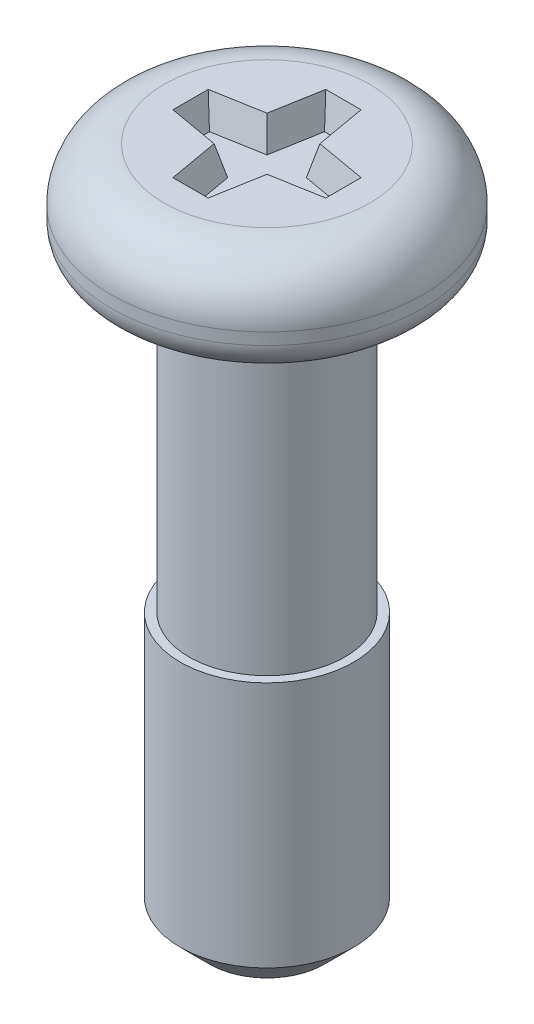
ISO-10303-21;
HEADER;
FILE_DESCRIPTION(('STEP AP214'),'2;1');
FILE_NAME('part.step','',(''),(''),'','','');
FILE_SCHEMA(('AUTOMOTIVE_DESIGN { 1 0 10303 214 1 1 1 1 }'));
ENDSEC;
DATA;
#1=APPLICATION_CONTEXT('core data for automotive mechanical design processes');
#2=APPLICATION_PROTOCOL_DEFINITION('international standard','automotive_design',2000,#1);
#3=PRODUCT_CONTEXT('',#1,'mechanical');
#4=PRODUCT('Part','Part','',(#3));
#5=PRODUCT_RELATED_PRODUCT_CATEGORY('part','',(#4));
#6=PRODUCT_DEFINITION_FORMATION('','',#4);
#7=PRODUCT_DEFINITION_CONTEXT('part definition',#1,'design');
#8=PRODUCT_DEFINITION('design','',#6,#7);
#9=PRODUCT_DEFINITION_SHAPE('','',#8);
#10=(LENGTH_UNIT() NAMED_UNIT(*) SI_UNIT(.MILLI.,.METRE.));
#11=(NAMED_UNIT(*) PLANE_ANGLE_UNIT() SI_UNIT($,.RADIAN.));
#12=(NAMED_UNIT(*) SI_UNIT($,.STERADIAN.) SOLID_ANGLE_UNIT());
#13=UNCERTAINTY_MEASURE_WITH_UNIT(LENGTH_MEASURE(1.E-05),#10,'distance_accuracy_value','');
#14=(GEOMETRIC_REPRESENTATION_CONTEXT(3) GLOBAL_UNCERTAINTY_ASSIGNED_CONTEXT((#13)) GLOBAL_UNIT_ASSIGNED_CONTEXT((#10,
#11,#12)) REPRESENTATION_CONTEXT('',''));
#15=CARTESIAN_POINT('',(0.,0.,0.));
#16=DIRECTION('',(0.,0.,1.));
#17=DIRECTION('',(1.,0.,0.));
#18=AXIS2_PLACEMENT_3D('',#15,#16,#17);
#19=CARTESIAN_POINT('',(1.75,0.,0.));
#20=DIRECTION('',(0.,-1.,0.));
#21=DIRECTION('',(1.,0.,0.));
#22=AXIS2_PLACEMENT_3D('',#19,#20,#21);
#23=PLANE('',#22);
#24=DIRECTION('',(-1.,0.,0.));
#25=VECTOR('',#24,1.);
#26=CARTESIAN_POINT('',(-0.300122066397808,0.,-1.3));
#27=LINE('',#26,#25);
#28=CARTESIAN_POINT('',(0.300122066397808,0.,-1.3));
#29=VERTEX_POINT('',#28);
#30=CARTESIAN_POINT('',(-0.300122066397808,0.,-1.3));
#31=VERTEX_POINT('',#30);
#32=EDGE_CURVE('E141',#29,#31,#27,.T.);
#33=ORIENTED_EDGE('',*,*,#32,.F.);
#34=DIRECTION('',(-0.173648177666927,0.,-0.984807753012208));
#35=VECTOR('',#34,1.);
#36=CARTESIAN_POINT('',(0.300122066397808,0.,-1.3));
#37=LINE('',#36,#35);
#38=CARTESIAN_POINT('',(0.45,0.,-0.45));
#39=VERTEX_POINT('',#38);
#40=EDGE_CURVE('E49',#39,#29,#37,.T.);
#41=ORIENTED_EDGE('',*,*,#40,.F.);
#42=DIRECTION('',(-0.984807753012208,0.,-0.173648177666927));
#43=VECTOR('',#42,1.);
#44=CARTESIAN_POINT('',(0.45,0.,-0.45));
#45=LINE('',#44,#43);
#46=CARTESIAN_POINT('',(1.3,0.,-0.300122066397808));
#47=VERTEX_POINT('',#46);
#48=EDGE_CURVE('E173',#47,#39,#45,.T.);
#49=ORIENTED_EDGE('',*,*,#48,.F.);
#50=DIRECTION('',(0.,0.,-1.));
#51=VECTOR('',#50,1.);
#52=CARTESIAN_POINT('',(1.3,0.,-0.300122066397808));
#53=LINE('',#52,#51);
#54=CARTESIAN_POINT('',(1.3,0.,0.300122066397808));
#55=VERTEX_POINT('',#54);
#56=EDGE_CURVE('E171',#55,#47,#53,.T.);
#57=ORIENTED_EDGE('',*,*,#56,.F.);
#58=DIRECTION('',(0.984807753012208,0.,-0.173648177666927));
#59=VECTOR('',#58,1.);
#60=CARTESIAN_POINT('',(0.45,0.,0.45));
#61=LINE('',#60,#59);
#62=CARTESIAN_POINT('',(0.45,0.,0.45));
#63=VERTEX_POINT('',#62);
#64=EDGE_CURVE('E168',#63,#55,#61,.T.);
#65=ORIENTED_EDGE('',*,*,#64,.F.);
#66=DIRECTION('',(0.173648177666927,0.,-0.984807753012208));
#67=VECTOR('',#66,1.);
#68=CARTESIAN_POINT('',(0.300122066397808,0.,1.3));
#69=LINE('',#68,#67);
#70=CARTESIAN_POINT('',(0.300122066397808,0.,1.3));
#71=VERTEX_POINT('',#70);
#72=EDGE_CURVE('E165',#71,#63,#69,.T.);
#73=ORIENTED_EDGE('',*,*,#72,.F.);
#74=DIRECTION('',(1.,0.,0.));
#75=VECTOR('',#74,1.);
#76=CARTESIAN_POINT('',(-0.300122066397808,0.,1.3));
#77=LINE('',#76,#75);
#78=CARTESIAN_POINT('',(-0.300122066397808,0.,1.3));
#79=VERTEX_POINT('',#78);
#80=EDGE_CURVE('E162',#79,#71,#77,.T.);
#81=ORIENTED_EDGE('',*,*,#80,.F.);
#82=DIRECTION('',(0.173648177666927,0.,0.984807753012208));
#83=VECTOR('',#82,1.);
#84=CARTESIAN_POINT('',(-0.300122066397808,0.,1.3));
#85=LINE('',#84,#83);
#86=CARTESIAN_POINT('',(-0.45,0.,0.45));
#87=VERTEX_POINT('',#86);
#88=EDGE_CURVE('E159',#87,#79,#85,.T.);
#89=ORIENTED_EDGE('',*,*,#88,.F.);
#90=DIRECTION('',(0.984807753012208,0.,0.173648177666927));
#91=VECTOR('',#90,1.);
#92=CARTESIAN_POINT('',(-0.45,0.,0.45));
#93=LINE('',#92,#91);
#94=CARTESIAN_POINT('',(-1.3,0.,0.300122066397808));
#95=VERTEX_POINT('',#94);
#96=EDGE_CURVE('E156',#95,#87,#93,.T.);
#97=ORIENTED_EDGE('',*,*,#96,.F.);
#98=DIRECTION('',(0.,0.,1.));
#99=VECTOR('',#98,1.);
#100=CARTESIAN_POINT('',(-1.3,0.,-0.300122066397808));
#101=LINE('',#100,#99);
#102=CARTESIAN_POINT('',(-1.3,0.,-0.300122066397808));
#103=VERTEX_POINT('',#102);
#104=EDGE_CURVE('E150',#103,#95,#101,.T.);
#105=ORIENTED_EDGE('',*,*,#104,.F.);
#106=DIRECTION('',(-0.984807753012208,0.,0.173648177666927));
#107=VECTOR('',#106,1.);
#108=CARTESIAN_POINT('',(-0.45,0.,-0.45));
#109=LINE('',#108,#107);
#110=CARTESIAN_POINT('',(-0.45,0.,-0.45));
#111=VERTEX_POINT('',#110);
#112=EDGE_CURVE('E148',#111,#103,#109,.T.);
#113=ORIENTED_EDGE('',*,*,#112,.F.);
#114=DIRECTION('',(-0.173648177666927,0.,0.984807753012208));
#115=VECTOR('',#114,1.);
#116=CARTESIAN_POINT('',(-0.300122066397808,0.,-1.3));
#117=LINE('',#116,#115);
#118=EDGE_CURVE('E132',#31,#111,#117,.T.);
#119=ORIENTED_EDGE('',*,*,#118,.F.);
#120=EDGE_LOOP('',(#33,#41,#49,#57,#65,#73,#81,#89,#97,#105,#113,#119));
#121=FACE_BOUND('',#120,.T.);
#122=CARTESIAN_POINT('',(0.,0.,0.));
#123=DIRECTION('',(0.,1.,0.));
#124=DIRECTION('',(-1.,0.,0.));
#125=AXIS2_PLACEMENT_3D('',#122,#123,#124);
#126=CIRCLE('',#125,1.75);
#127=CARTESIAN_POINT('',(-1.75,0.,0.));
#128=VERTEX_POINT('',#127);
#129=EDGE_CURVE('E11',#128,#128,#126,.T.);
#130=ORIENTED_EDGE('',*,*,#129,.T.);
#131=EDGE_LOOP('',(#130));
#132=FACE_BOUND('',#131,.T.);
#133=ADVANCED_FACE('F35',(#121,#132),#23,.F.);
#134=CARTESIAN_POINT('',(0.,-0.9,0.));
#135=DIRECTION('',(0.,1.,0.));
#136=DIRECTION('',(-1.,0.,0.));
#137=AXIS2_PLACEMENT_3D('',#134,#135,#136);
#138=TOROIDAL_SURFACE('',#137,1.75,0.9);
#139=ORIENTED_EDGE('',*,*,#129,.F.);
#140=EDGE_LOOP('',(#139));
#141=FACE_BOUND('',#140,.T.);
#142=CARTESIAN_POINT('',(0.,-0.9,0.));
#143=DIRECTION('',(0.,1.,0.));
#144=DIRECTION('',(-1.,0.,0.));
#145=AXIS2_PLACEMENT_3D('',#142,#143,#144);
#146=CIRCLE('',#145,2.65);
#147=CARTESIAN_POINT('',(-2.65,-0.900000000000001,0.));
#148=VERTEX_POINT('',#147);
#149=EDGE_CURVE('E42',#148,#148,#146,.T.);
#150=ORIENTED_EDGE('',*,*,#149,.T.);
#151=EDGE_LOOP('',(#150));
#152=FACE_BOUND('',#151,.T.);
#153=ADVANCED_FACE('F252',(#141,#152),#138,.T.);
#154=CARTESIAN_POINT('',(0.,0.,0.));
#155=DIRECTION('',(0.,1.,0.));
#156=DIRECTION('',(-1.,0.,0.));
#157=AXIS2_PLACEMENT_3D('',#154,#155,#156);
#158=CYLINDRICAL_SURFACE('',#157,2.65);
#159=ORIENTED_EDGE('',*,*,#149,.F.);
#160=EDGE_LOOP('',(#159));
#161=FACE_BOUND('',#160,.T.);
#162=CARTESIAN_POINT('',(0.,-1.1,0.));
#163=DIRECTION('',(0.,1.,0.));
#164=DIRECTION('',(-1.,0.,0.));
#165=AXIS2_PLACEMENT_3D('',#162,#163,#164);
#166=CIRCLE('',#165,2.65);
#167=CARTESIAN_POINT('',(-2.65,-1.1,0.));
#168=VERTEX_POINT('',#167);
#169=EDGE_CURVE('E247',#168,#168,#166,.T.);
#170=ORIENTED_EDGE('',*,*,#169,.T.);
#171=EDGE_LOOP('',(#170));
#172=FACE_BOUND('',#171,.T.);
#173=ADVANCED_FACE('F254',(#161,#172),#158,.T.);
#174=CARTESIAN_POINT('',(0.,-1.1,0.));
#175=DIRECTION('',(0.,1.,0.));
#176=DIRECTION('',(-1.,0.,0.));
#177=AXIS2_PLACEMENT_3D('',#174,#175,#176);
#178=TOROIDAL_SURFACE('',#177,2.15,0.5);
#179=ORIENTED_EDGE('',*,*,#169,.F.);
#180=EDGE_LOOP('',(#179));
#181=FACE_BOUND('',#180,.T.);
#182=CARTESIAN_POINT('',(0.,-1.6,0.));
#183=DIRECTION('',(0.,1.,0.));
#184=DIRECTION('',(-1.,0.,0.));
#185=AXIS2_PLACEMENT_3D('',#182,#183,#184);
#186=CIRCLE('',#185,2.15);
#187=CARTESIAN_POINT('',(-2.15,-1.6,0.));
#188=VERTEX_POINT('',#187);
#189=EDGE_CURVE('E244',#188,#188,#186,.T.);
#190=ORIENTED_EDGE('',*,*,#189,.T.);
#191=EDGE_LOOP('',(#190));
#192=FACE_BOUND('',#191,.T.);
#193=ADVANCED_FACE('F257',(#181,#192),#178,.T.);
#194=CARTESIAN_POINT('',(1.475,-1.6,0.));
#195=DIRECTION('',(0.,1.,0.));
#196=DIRECTION('',(-1.,0.,0.));
#197=AXIS2_PLACEMENT_3D('',#194,#195,#196);
#198=PLANE('',#197);
#199=ORIENTED_EDGE('',*,*,#189,.F.);
#200=EDGE_LOOP('',(#199));
#201=FACE_BOUND('',#200,.T.);
#202=CARTESIAN_POINT('',(0.,-1.6,0.));
#203=DIRECTION('',(0.,1.,0.));
#204=DIRECTION('',(-1.,0.,0.));
#205=AXIS2_PLACEMENT_3D('',#202,#203,#204);
#206=CIRCLE('',#205,1.475);
#207=CARTESIAN_POINT('',(-1.475,-1.6,0.));
#208=VERTEX_POINT('',#207);
#209=EDGE_CURVE('E241',#208,#208,#206,.T.);
#210=ORIENTED_EDGE('',*,*,#209,.T.);
#211=EDGE_LOOP('',(#210));
#212=FACE_BOUND('',#211,.T.);
#213=ADVANCED_FACE('F263',(#201,#212),#198,.F.);
#214=CARTESIAN_POINT('',(0.,-1.75,0.));
#215=DIRECTION('',(0.,1.,0.));
#216=DIRECTION('',(-1.,0.,0.));
#217=AXIS2_PLACEMENT_3D('',#214,#215,#216);
#218=TOROIDAL_SURFACE('',#217,1.475,0.15);
#219=ORIENTED_EDGE('',*,*,#209,.F.);
#220=EDGE_LOOP('',(#219));
#221=FACE_BOUND('',#220,.T.);
#222=CARTESIAN_POINT('',(0.,-1.75,0.));
#223=DIRECTION('',(0.,1.,0.));
#224=DIRECTION('',(-1.,0.,0.));
#225=AXIS2_PLACEMENT_3D('',#222,#223,#224);
#226=CIRCLE('',#225,1.325);
#227=CARTESIAN_POINT('',(-1.325,-1.75,0.));
#228=VERTEX_POINT('',#227);
#229=EDGE_CURVE('E238',#228,#228,#226,.T.);
#230=ORIENTED_EDGE('',*,*,#229,.T.);
#231=EDGE_LOOP('',(#230));
#232=FACE_BOUND('',#231,.T.);
#233=ADVANCED_FACE('F269',(#221,#232),#218,.F.);
#234=CARTESIAN_POINT('',(0.,0.,0.));
#235=DIRECTION('',(0.,1.,0.));
#236=DIRECTION('',(-1.,0.,0.));
#237=AXIS2_PLACEMENT_3D('',#234,#235,#236);
#238=CYLINDRICAL_SURFACE('',#237,1.325);
#239=ORIENTED_EDGE('',*,*,#229,.F.);
#240=EDGE_LOOP('',(#239));
#241=FACE_BOUND('',#240,.T.);
#242=CARTESIAN_POINT('',(0.,-6.9,0.));
#243=DIRECTION('',(0.,1.,0.));
#244=DIRECTION('',(-1.,0.,0.));
#245=AXIS2_PLACEMENT_3D('',#242,#243,#244);
#246=CIRCLE('',#245,1.325);
#247=CARTESIAN_POINT('',(-1.325,-6.9,0.));
#248=VERTEX_POINT('',#247);
#249=EDGE_CURVE('E235',#248,#248,#246,.T.);
#250=ORIENTED_EDGE('',*,*,#249,.T.);
#251=EDGE_LOOP('',(#250));
#252=FACE_BOUND('',#251,.T.);
#253=ADVANCED_FACE('F275',(#241,#252),#238,.T.);
#254=CARTESIAN_POINT('',(1.325,-6.9,0.));
#255=DIRECTION('',(0.,-1.,0.));
#256=DIRECTION('',(1.,0.,0.));
#257=AXIS2_PLACEMENT_3D('',#254,#255,#256);
#258=PLANE('',#257);
#259=ORIENTED_EDGE('',*,*,#249,.F.);
#260=EDGE_LOOP('',(#259));
#261=FACE_BOUND('',#260,.T.);
#262=CARTESIAN_POINT('',(0.,-6.9,0.));
#263=DIRECTION('',(0.,1.,0.));
#264=DIRECTION('',(-1.,0.,0.));
#265=AXIS2_PLACEMENT_3D('',#262,#263,#264);
#266=CIRCLE('',#265,1.475);
#267=CARTESIAN_POINT('',(-1.475,-6.9,0.));
#268=VERTEX_POINT('',#267);
#269=EDGE_CURVE('E232',#268,#268,#266,.T.);
#270=ORIENTED_EDGE('',*,*,#269,.T.);
#271=EDGE_LOOP('',(#270));
#272=FACE_BOUND('',#271,.T.);
#273=ADVANCED_FACE('F281',(#261,#272),#258,.F.);
#274=CARTESIAN_POINT('',(0.,0.,0.));
#275=DIRECTION('',(0.,1.,0.));
#276=DIRECTION('',(-1.,0.,0.));
#277=AXIS2_PLACEMENT_3D('',#274,#275,#276);
#278=CYLINDRICAL_SURFACE('',#277,1.475);
#279=ORIENTED_EDGE('',*,*,#269,.F.);
#280=EDGE_LOOP('',(#279));
#281=FACE_BOUND('',#280,.T.);
#282=CARTESIAN_POINT('',(0.,-11.1,0.));
#283=DIRECTION('',(0.,1.,0.));
#284=DIRECTION('',(-1.,0.,0.));
#285=AXIS2_PLACEMENT_3D('',#282,#283,#284);
#286=CIRCLE('',#285,1.475);
#287=CARTESIAN_POINT('',(-1.475,-11.1,0.));
#288=VERTEX_POINT('',#287);
#289=EDGE_CURVE('E229',#288,#288,#286,.T.);
#290=ORIENTED_EDGE('',*,*,#289,.T.);
#291=EDGE_LOOP('',(#290));
#292=FACE_BOUND('',#291,.T.);
#293=ADVANCED_FACE('F287',(#281,#292),#278,.T.);
#294=CARTESIAN_POINT('',(0.,-11.6,0.));
#295=DIRECTION('',(0.,1.,0.));
#296=DIRECTION('',(-1.,0.,0.));
#297=AXIS2_PLACEMENT_3D('',#294,#295,#296);
#298=CONICAL_SURFACE('',#297,0.975000000000005,0.785398163397443);
#299=ORIENTED_EDGE('',*,*,#289,.F.);
#300=EDGE_LOOP('',(#299));
#301=FACE_BOUND('',#300,.T.);
#302=CARTESIAN_POINT('',(0.,-11.6,0.));
#303=DIRECTION('',(0.,1.,0.));
#304=DIRECTION('',(-1.,0.,0.));
#305=AXIS2_PLACEMENT_3D('',#302,#303,#304);
#306=CIRCLE('',#305,0.975000000000005);
#307=CARTESIAN_POINT('',(-0.975000000000003,-11.6,0.));
#308=VERTEX_POINT('',#307);
#309=EDGE_CURVE('E177',#308,#308,#306,.T.);
#310=ORIENTED_EDGE('',*,*,#309,.T.);
#311=EDGE_LOOP('',(#310));
#312=FACE_BOUND('',#311,.T.);
#313=ADVANCED_FACE('F293',(#301,#312),#298,.T.);
#314=CARTESIAN_POINT('',(0.,-11.6,0.));
#315=DIRECTION('',(0.,1.,0.));
#316=DIRECTION('',(-1.,0.,0.));
#317=AXIS2_PLACEMENT_3D('',#314,#315,#316);
#318=PLANE('',#317);
#319=ORIENTED_EDGE('',*,*,#309,.F.);
#320=EDGE_LOOP('',(#319));
#321=FACE_BOUND('',#320,.T.);
#322=ADVANCED_FACE('F299',(#321),#318,.F.);
#323=CARTESIAN_POINT('',(0.300122066397808,0.,-1.3));
#324=DIRECTION('',(0.951251242564198,-0.258819045102521,-0.167731259496517));
#325=DIRECTION('',(0.262538491736643,0.964921520309631,0.));
#326=AXIS2_PLACEMENT_3D('',#323,#324,#325);
#327=PLANE('',#326);
#328=ORIENTED_EDGE('',*,*,#40,.T.);
#329=DIRECTION('',(0.212227769095221,0.943922256203466,-0.252923206267483));
#330=VECTOR('',#329,1.);
#331=CARTESIAN_POINT('',(0.300122066397808,0.,-1.3));
#332=LINE('',#331,#330);
#333=CARTESIAN_POINT('',(0.187704032126204,-0.5,-1.16602540378444));
#334=VERTEX_POINT('',#333);
#335=EDGE_CURVE('E92',#334,#29,#332,.T.);
#336=ORIENTED_EDGE('',*,*,#335,.F.);
#337=DIRECTION('',(-0.173648177666927,0.,-0.984807753012209));
#338=VECTOR('',#337,1.);
#339=CARTESIAN_POINT('',(0.381446150865339,-0.5,-0.0672592480849495));
#340=LINE('',#339,#338);
#341=CARTESIAN_POINT('',(0.33435071834194,-0.5,-0.33435071834194));
#342=VERTEX_POINT('',#341);
#343=EDGE_CURVE('E175',#342,#334,#340,.T.);
#344=ORIENTED_EDGE('',*,*,#343,.F.);
#345=DIRECTION('',(0.219836351209983,0.950444084296053,-0.219836351209983));
#346=VECTOR('',#345,1.);
#347=CARTESIAN_POINT('',(0.483835514146798,0.146285016481293,-0.483835514146798));
#348=LINE('',#347,#346);
#349=EDGE_CURVE('E57',#342,#39,#348,.T.);
#350=ORIENTED_EDGE('',*,*,#349,.T.);
#351=EDGE_LOOP('',(#328,#336,#344,#350));
#352=FACE_BOUND('',#351,.T.);
#353=ADVANCED_FACE('F304',(#352),#327,.F.);
#354=CARTESIAN_POINT('',(0.45,0.,-0.45));
#355=DIRECTION('',(0.167731259496517,-0.258819045102521,-0.951251242564198));
#356=DIRECTION('',(0.,0.964921520309631,-0.262538491736643));
#357=AXIS2_PLACEMENT_3D('',#354,#355,#356);
#358=PLANE('',#357);
#359=ORIENTED_EDGE('',*,*,#48,.T.);
#360=ORIENTED_EDGE('',*,*,#349,.F.);
#361=DIRECTION('',(-0.984807753012209,0.,-0.173648177666927));
#362=VECTOR('',#361,1.);
#363=CARTESIAN_POINT('',(0.0672592480849496,-0.5,-0.381446150865339));
#364=LINE('',#363,#362);
#365=CARTESIAN_POINT('',(1.16602540378444,-0.5,-0.187704032126204));
#366=VERTEX_POINT('',#365);
#367=EDGE_CURVE('E178',#366,#342,#364,.T.);
#368=ORIENTED_EDGE('',*,*,#367,.F.);
#369=DIRECTION('',(0.252923206267483,0.943922256203466,-0.212227769095221));
#370=VECTOR('',#369,1.);
#371=CARTESIAN_POINT('',(1.3,0.,-0.300122066397808));
#372=LINE('',#371,#370);
#373=EDGE_CURVE('E97',#366,#47,#372,.T.);
#374=ORIENTED_EDGE('',*,*,#373,.T.);
#375=EDGE_LOOP('',(#359,#360,#368,#374));
#376=FACE_BOUND('',#375,.T.);
#377=ADVANCED_FACE('F309',(#376),#358,.F.);
#378=CARTESIAN_POINT('',(1.3,0.,-0.300122066397808));
#379=DIRECTION('',(0.965925826289068,-0.258819045102521,0.));
#380=DIRECTION('',(0.258819045102521,0.965925826289068,0.));
#381=AXIS2_PLACEMENT_3D('',#378,#379,#380);
#382=PLANE('',#381);
#383=ORIENTED_EDGE('',*,*,#56,.T.);
#384=ORIENTED_EDGE('',*,*,#373,.F.);
#385=DIRECTION('',(0.,0.,-1.));
#386=VECTOR('',#385,1.);
#387=CARTESIAN_POINT('',(1.16602540378444,-0.5,0.));
#388=LINE('',#387,#386);
#389=CARTESIAN_POINT('',(1.16602540378444,-0.5,0.187704032126204));
#390=VERTEX_POINT('',#389);
#391=EDGE_CURVE('E201',#390,#366,#388,.T.);
#392=ORIENTED_EDGE('',*,*,#391,.F.);
#393=DIRECTION('',(0.252923206267483,0.943922256203466,0.212227769095221));
#394=VECTOR('',#393,1.);
#395=CARTESIAN_POINT('',(1.2536704209464,-0.172904342921303,0.261246933701336));
#396=LINE('',#395,#394);
#397=EDGE_CURVE('E193',#390,#55,#396,.T.);
#398=ORIENTED_EDGE('',*,*,#397,.T.);
#399=EDGE_LOOP('',(#383,#384,#392,#398));
#400=FACE_BOUND('',#399,.T.);
#401=ADVANCED_FACE('F377',(#400),#382,.F.);
#402=CARTESIAN_POINT('',(0.45,0.,0.45));
#403=DIRECTION('',(0.167731259496517,-0.258819045102521,0.951251242564198));
#404=DIRECTION('',(0.,-0.964921520309631,-0.262538491736643));
#405=AXIS2_PLACEMENT_3D('',#402,#403,#404);
#406=PLANE('',#405);
#407=ORIENTED_EDGE('',*,*,#64,.T.);
#408=ORIENTED_EDGE('',*,*,#397,.F.);
#409=DIRECTION('',(0.984807753012209,0.,-0.173648177666927));
#410=VECTOR('',#409,1.);
#411=CARTESIAN_POINT('',(0.0672592480849496,-0.5,0.381446150865339));
#412=LINE('',#411,#410);
#413=CARTESIAN_POINT('',(0.33435071834194,-0.5,0.33435071834194));
#414=VERTEX_POINT('',#413);
#415=EDGE_CURVE('E204',#414,#390,#412,.T.);
#416=ORIENTED_EDGE('',*,*,#415,.F.);
#417=DIRECTION('',(0.219836351209983,0.950444084296053,0.219836351209983));
#418=VECTOR('',#417,1.);
#419=CARTESIAN_POINT('',(0.45,0.,0.45));
#420=LINE('',#419,#418);
#421=EDGE_CURVE('E191',#414,#63,#420,.T.);
#422=ORIENTED_EDGE('',*,*,#421,.T.);
#423=EDGE_LOOP('',(#407,#408,#416,#422));
#424=FACE_BOUND('',#423,.T.);
#425=ADVANCED_FACE('F385',(#424),#406,.F.);
#426=CARTESIAN_POINT('',(0.300122066397808,0.,1.3));
#427=DIRECTION('',(0.951251242564198,-0.258819045102521,0.167731259496517));
#428=DIRECTION('',(0.262538491736643,0.964921520309631,0.));
#429=AXIS2_PLACEMENT_3D('',#426,#427,#428);
#430=PLANE('',#429);
#431=ORIENTED_EDGE('',*,*,#72,.T.);
#432=ORIENTED_EDGE('',*,*,#421,.F.);
#433=DIRECTION('',(0.173648177666927,0.,-0.984807753012209));
#434=VECTOR('',#433,1.);
#435=CARTESIAN_POINT('',(0.381446150865339,-0.5,0.0672592480849495));
#436=LINE('',#435,#434);
#437=CARTESIAN_POINT('',(0.187704032126204,-0.5,1.16602540378444));
#438=VERTEX_POINT('',#437);
#439=EDGE_CURVE('E207',#438,#414,#436,.T.);
#440=ORIENTED_EDGE('',*,*,#439,.F.);
#441=DIRECTION('',(0.212227769095221,0.943922256203466,0.252923206267483));
#442=VECTOR('',#441,1.);
#443=CARTESIAN_POINT('',(0.273086694918792,-0.120244815052087,1.26778049891276));
#444=LINE('',#443,#442);
#445=EDGE_CURVE('E189',#438,#71,#444,.T.);
#446=ORIENTED_EDGE('',*,*,#445,.T.);
#447=EDGE_LOOP('',(#431,#432,#440,#446));
#448=FACE_BOUND('',#447,.T.);
#449=ADVANCED_FACE('F395',(#448),#430,.F.);
#450=CARTESIAN_POINT('',(-0.300122066397808,0.,1.3));
#451=DIRECTION('',(0.,-0.258819045102521,0.965925826289068));
#452=DIRECTION('',(0.,-0.965925826289068,-0.258819045102521));
#453=AXIS2_PLACEMENT_3D('',#450,#451,#452);
#454=PLANE('',#453);
#455=ORIENTED_EDGE('',*,*,#80,.T.);
#456=ORIENTED_EDGE('',*,*,#445,.F.);
#457=DIRECTION('',(1.,0.,0.));
#458=VECTOR('',#457,1.);
#459=CARTESIAN_POINT('',(0.,-0.5,1.16602540378444));
#460=LINE('',#459,#458);
#461=CARTESIAN_POINT('',(-0.187704032126204,-0.5,1.16602540378444));
#462=VERTEX_POINT('',#461);
#463=EDGE_CURVE('E210',#462,#438,#460,.T.);
#464=ORIENTED_EDGE('',*,*,#463,.F.);
#465=DIRECTION('',(-0.212227769095221,0.943922256203466,0.252923206267483));
#466=VECTOR('',#465,1.);
#467=CARTESIAN_POINT('',(-0.300122066397808,0.,1.3));
#468=LINE('',#467,#466);
#469=EDGE_CURVE('E187',#462,#79,#468,.T.);
#470=ORIENTED_EDGE('',*,*,#469,.T.);
#471=EDGE_LOOP('',(#455,#456,#464,#470));
#472=FACE_BOUND('',#471,.T.);
#473=ADVANCED_FACE('F405',(#472),#454,.F.);
#474=CARTESIAN_POINT('',(-0.300122066397808,0.,1.3));
#475=DIRECTION('',(-0.951251242564198,-0.258819045102521,0.167731259496517));
#476=DIRECTION('',(0.262538491736643,-0.964921520309631,0.));
#477=AXIS2_PLACEMENT_3D('',#474,#475,#476);
#478=PLANE('',#477);
#479=ORIENTED_EDGE('',*,*,#88,.T.);
#480=ORIENTED_EDGE('',*,*,#469,.F.);
#481=DIRECTION('',(0.173648177666927,0.,0.984807753012209));
#482=VECTOR('',#481,1.);
#483=CARTESIAN_POINT('',(-0.381446150865339,-0.5,0.0672592480849495));
#484=LINE('',#483,#482);
#485=CARTESIAN_POINT('',(-0.33435071834194,-0.5,0.33435071834194));
#486=VERTEX_POINT('',#485);
#487=EDGE_CURVE('E213',#486,#462,#484,.T.);
#488=ORIENTED_EDGE('',*,*,#487,.F.);
#489=DIRECTION('',(-0.219836351209983,0.950444084296053,0.219836351209983));
#490=VECTOR('',#489,1.);
#491=CARTESIAN_POINT('',(-0.483835514146798,0.146285016481293,0.483835514146798));
#492=LINE('',#491,#490);
#493=EDGE_CURVE('E185',#486,#87,#492,.T.);
#494=ORIENTED_EDGE('',*,*,#493,.T.);
#495=EDGE_LOOP('',(#479,#480,#488,#494));
#496=FACE_BOUND('',#495,.T.);
#497=ADVANCED_FACE('F415',(#496),#478,.F.);
#498=CARTESIAN_POINT('',(-0.45,0.,0.45));
#499=DIRECTION('',(-0.167731259496517,-0.258819045102521,0.951251242564198));
#500=DIRECTION('',(0.,-0.964921520309631,-0.262538491736643));
#501=AXIS2_PLACEMENT_3D('',#498,#499,#500);
#502=PLANE('',#501);
#503=ORIENTED_EDGE('',*,*,#96,.T.);
#504=ORIENTED_EDGE('',*,*,#493,.F.);
#505=DIRECTION('',(0.984807753012209,0.,0.173648177666927));
#506=VECTOR('',#505,1.);
#507=CARTESIAN_POINT('',(-0.0672592480849494,-0.5,0.381446150865339));
#508=LINE('',#507,#506);
#509=CARTESIAN_POINT('',(-1.16602540378444,-0.5,0.187704032126204));
#510=VERTEX_POINT('',#509);
#511=EDGE_CURVE('E216',#510,#486,#508,.T.);
#512=ORIENTED_EDGE('',*,*,#511,.F.);
#513=DIRECTION('',(-0.252923206267483,0.943922256203466,0.212227769095221));
#514=VECTOR('',#513,1.);
#515=CARTESIAN_POINT('',(-1.26778049891276,-0.120244815052087,0.273086694918791));
#516=LINE('',#515,#514);
#517=EDGE_CURVE('E183',#510,#95,#516,.T.);
#518=ORIENTED_EDGE('',*,*,#517,.T.);
#519=EDGE_LOOP('',(#503,#504,#512,#518));
#520=FACE_BOUND('',#519,.T.);
#521=ADVANCED_FACE('F425',(#520),#502,.F.);
#522=CARTESIAN_POINT('',(-1.3,0.,-0.300122066397808));
#523=DIRECTION('',(-0.965925826289068,-0.258819045102521,0.));
#524=DIRECTION('',(0.258819045102521,-0.965925826289068,0.));
#525=AXIS2_PLACEMENT_3D('',#522,#523,#524);
#526=PLANE('',#525);
#527=ORIENTED_EDGE('',*,*,#104,.T.);
#528=ORIENTED_EDGE('',*,*,#517,.F.);
#529=DIRECTION('',(0.,0.,1.));
#530=VECTOR('',#529,1.);
#531=CARTESIAN_POINT('',(-1.16602540378444,-0.5,0.));
#532=LINE('',#531,#530);
#533=CARTESIAN_POINT('',(-1.16602540378444,-0.5,-0.187704032126204));
#534=VERTEX_POINT('',#533);
#535=EDGE_CURVE('E219',#534,#510,#532,.T.);
#536=ORIENTED_EDGE('',*,*,#535,.F.);
#537=DIRECTION('',(-0.252923206267483,0.943922256203466,-0.212227769095221));
#538=VECTOR('',#537,1.);
#539=CARTESIAN_POINT('',(-1.2536704209464,-0.172904342921303,-0.261246933701336));
#540=LINE('',#539,#538);
#541=EDGE_CURVE('E181',#534,#103,#540,.T.);
#542=ORIENTED_EDGE('',*,*,#541,.T.);
#543=EDGE_LOOP('',(#527,#528,#536,#542));
#544=FACE_BOUND('',#543,.T.);
#545=ADVANCED_FACE('F435',(#544),#526,.F.);
#546=CARTESIAN_POINT('',(-0.45,0.,-0.45));
#547=DIRECTION('',(-0.167731259496517,-0.258819045102521,-0.951251242564198));
#548=DIRECTION('',(0.,0.964921520309631,-0.262538491736643));
#549=AXIS2_PLACEMENT_3D('',#546,#547,#548);
#550=PLANE('',#549);
#551=ORIENTED_EDGE('',*,*,#112,.T.);
#552=ORIENTED_EDGE('',*,*,#541,.F.);
#553=DIRECTION('',(-0.984807753012209,0.,0.173648177666927));
#554=VECTOR('',#553,1.);
#555=CARTESIAN_POINT('',(-0.0672592480849494,-0.5,-0.381446150865339));
#556=LINE('',#555,#554);
#557=CARTESIAN_POINT('',(-0.33435071834194,-0.5,-0.33435071834194));
#558=VERTEX_POINT('',#557);
#559=EDGE_CURVE('E222',#558,#534,#556,.T.);
#560=ORIENTED_EDGE('',*,*,#559,.F.);
#561=DIRECTION('',(-0.219836351209983,0.950444084296053,-0.219836351209983));
#562=VECTOR('',#561,1.);
#563=CARTESIAN_POINT('',(-0.45,0.,-0.45));
#564=LINE('',#563,#562);
#565=EDGE_CURVE('E138',#558,#111,#564,.T.);
#566=ORIENTED_EDGE('',*,*,#565,.T.);
#567=EDGE_LOOP('',(#551,#552,#560,#566));
#568=FACE_BOUND('',#567,.T.);
#569=ADVANCED_FACE('F445',(#568),#550,.F.);
#570=CARTESIAN_POINT('',(-0.300122066397808,0.,-1.3));
#571=DIRECTION('',(-0.951251242564198,-0.258819045102521,-0.167731259496517));
#572=DIRECTION('',(0.262538491736643,-0.964921520309631,0.));
#573=AXIS2_PLACEMENT_3D('',#570,#571,#572);
#574=PLANE('',#573);
#575=ORIENTED_EDGE('',*,*,#118,.T.);
#576=ORIENTED_EDGE('',*,*,#565,.F.);
#577=DIRECTION('',(-0.173648177666927,0.,0.984807753012209));
#578=VECTOR('',#577,1.);
#579=CARTESIAN_POINT('',(-0.381446150865339,-0.5,-0.0672592480849495));
#580=LINE('',#579,#578);
#581=CARTESIAN_POINT('',(-0.187704032126204,-0.5,-1.16602540378444));
#582=VERTEX_POINT('',#581);
#583=EDGE_CURVE('E135',#582,#558,#580,.T.);
#584=ORIENTED_EDGE('',*,*,#583,.F.);
#585=DIRECTION('',(-0.212227769095221,0.943922256203466,-0.252923206267483));
#586=VECTOR('',#585,1.);
#587=CARTESIAN_POINT('',(-0.300122066397808,0.,-1.3));
#588=LINE('',#587,#586);
#589=EDGE_CURVE('E128',#582,#31,#588,.T.);
#590=ORIENTED_EDGE('',*,*,#589,.T.);
#591=EDGE_LOOP('',(#575,#576,#584,#590));
#592=FACE_BOUND('',#591,.T.);
#593=ADVANCED_FACE('F130',(#592),#574,.F.);
#594=CARTESIAN_POINT('',(-0.300122066397808,0.,-1.3));
#595=DIRECTION('',(0.,-0.258819045102521,-0.965925826289068));
#596=DIRECTION('',(0.,0.965925826289068,-0.258819045102521));
#597=AXIS2_PLACEMENT_3D('',#594,#595,#596);
#598=PLANE('',#597);
#599=ORIENTED_EDGE('',*,*,#32,.T.);
#600=ORIENTED_EDGE('',*,*,#589,.F.);
#601=DIRECTION('',(-1.,0.,0.));
#602=VECTOR('',#601,1.);
#603=CARTESIAN_POINT('',(0.,-0.5,-1.16602540378444));
#604=LINE('',#603,#602);
#605=EDGE_CURVE('E198',#334,#582,#604,.T.);
#606=ORIENTED_EDGE('',*,*,#605,.F.);
#607=ORIENTED_EDGE('',*,*,#335,.T.);
#608=EDGE_LOOP('',(#599,#600,#606,#607));
#609=FACE_BOUND('',#608,.T.);
#610=ADVANCED_FACE('F142',(#609),#598,.F.);
#611=CARTESIAN_POINT('',(0.,-0.5,0.));
#612=DIRECTION('',(0.,1.,0.));
#613=DIRECTION('',(-1.,0.,0.));
#614=AXIS2_PLACEMENT_3D('',#611,#612,#613);
#615=PLANE('',#614);
#616=ORIENTED_EDGE('',*,*,#343,.T.);
#617=ORIENTED_EDGE('',*,*,#605,.T.);
#618=ORIENTED_EDGE('',*,*,#583,.T.);
#619=ORIENTED_EDGE('',*,*,#559,.T.);
#620=ORIENTED_EDGE('',*,*,#535,.T.);
#621=ORIENTED_EDGE('',*,*,#511,.T.);
#622=ORIENTED_EDGE('',*,*,#487,.T.);
#623=ORIENTED_EDGE('',*,*,#463,.T.);
#624=ORIENTED_EDGE('',*,*,#439,.T.);
#625=ORIENTED_EDGE('',*,*,#415,.T.);
#626=ORIENTED_EDGE('',*,*,#391,.T.);
#627=ORIENTED_EDGE('',*,*,#367,.T.);
#628=EDGE_LOOP('',(#616,#617,#618,#619,#620,#621,#622,#623,#624,#625,#626,#627));
#629=FACE_BOUND('',#628,.T.);
#630=ADVANCED_FACE('F472',(#629),#615,.T.);
#631=CLOSED_SHELL('',(#133,#153,#173,#193,#213,#233,#253,#273,#293,#313,#322,#353,#377,#401,
#425,#449,#473,#497,#521,#545,#569,#593,#610,#630));
#632=MANIFOLD_SOLID_BREP('B2',#631);
#633=ADVANCED_BREP_SHAPE_REPRESENTATION('',(#18,#632),#14);
#634=SHAPE_DEFINITION_REPRESENTATION(#9,#633);
ENDSEC;
END-ISO-10303-21;
